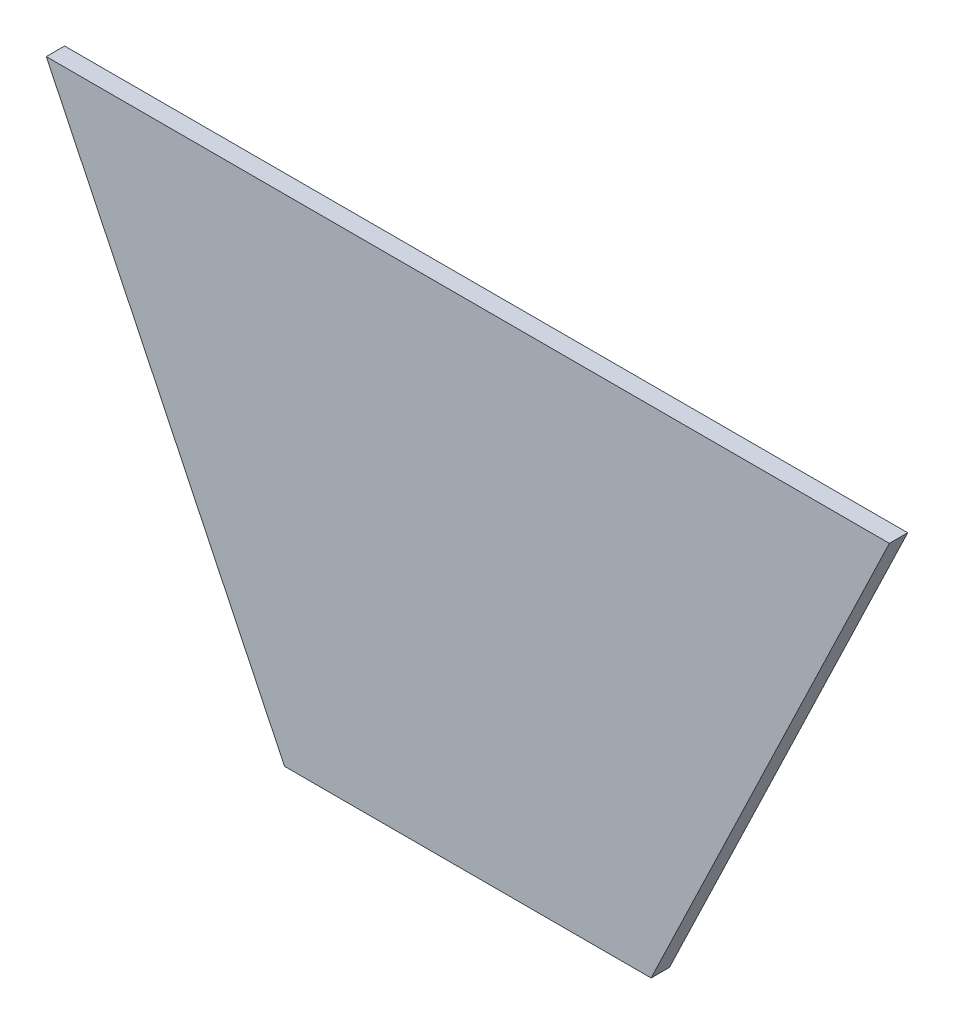
ISO-10303-21;
HEADER;
FILE_DESCRIPTION(('STEP AP214'),'2;1');
FILE_NAME('part.step','',(''),(''),'','','');
FILE_SCHEMA(('AUTOMOTIVE_DESIGN { 1 0 10303 214 1 1 1 1 }'));
ENDSEC;
DATA;
#1=APPLICATION_CONTEXT('core data for automotive mechanical design processes');
#2=APPLICATION_PROTOCOL_DEFINITION('international standard','automotive_design',2000,#1);
#3=PRODUCT_CONTEXT('',#1,'mechanical');
#4=PRODUCT('Part','Part','',(#3));
#5=PRODUCT_RELATED_PRODUCT_CATEGORY('part','',(#4));
#6=PRODUCT_DEFINITION_FORMATION('','',#4);
#7=PRODUCT_DEFINITION_CONTEXT('part definition',#1,'design');
#8=PRODUCT_DEFINITION('design','',#6,#7);
#9=PRODUCT_DEFINITION_SHAPE('','',#8);
#10=(LENGTH_UNIT() NAMED_UNIT(*) SI_UNIT(.MILLI.,.METRE.));
#11=(NAMED_UNIT(*) PLANE_ANGLE_UNIT() SI_UNIT($,.RADIAN.));
#12=(NAMED_UNIT(*) SI_UNIT($,.STERADIAN.) SOLID_ANGLE_UNIT());
#13=UNCERTAINTY_MEASURE_WITH_UNIT(LENGTH_MEASURE(1.E-05),#10,'distance_accuracy_value','');
#14=(GEOMETRIC_REPRESENTATION_CONTEXT(3) GLOBAL_UNCERTAINTY_ASSIGNED_CONTEXT((#13)) GLOBAL_UNIT_ASSIGNED_CONTEXT((#10,
#11,#12)) REPRESENTATION_CONTEXT('',''));
#15=CARTESIAN_POINT('',(0.,0.,0.));
#16=DIRECTION('',(0.,0.,1.));
#17=DIRECTION('',(1.,0.,0.));
#18=AXIS2_PLACEMENT_3D('',#15,#16,#17);
#19=CARTESIAN_POINT('',(-230.,270.370116691916,10.));
#20=DIRECTION('',(0.901233722306385,0.433333333333333,0.));
#21=DIRECTION('',(-0.433333333333333,0.901233722306385,0.));
#22=AXIS2_PLACEMENT_3D('',#19,#20,#21);
#23=PLANE('',#22);
#24=DIRECTION('',(0.433333333333333,-0.901233722306385,0.));
#25=VECTOR('',#24,1.);
#26=CARTESIAN_POINT('',(-230.,270.370116691916,0.));
#27=LINE('',#26,#25);
#28=CARTESIAN_POINT('',(-230.,270.370116691916,0.));
#29=VERTEX_POINT('',#28);
#30=CARTESIAN_POINT('',(-100.,0.,0.));
#31=VERTEX_POINT('',#30);
#32=EDGE_CURVE('E100',#29,#31,#27,.T.);
#33=ORIENTED_EDGE('',*,*,#32,.T.);
#34=DIRECTION('',(0.,0.,-1.));
#35=VECTOR('',#34,1.);
#36=CARTESIAN_POINT('',(-100.,0.,10.));
#37=LINE('',#36,#35);
#38=CARTESIAN_POINT('',(-100.,0.,10.));
#39=VERTEX_POINT('',#38);
#40=EDGE_CURVE('E11',#39,#31,#37,.T.);
#41=ORIENTED_EDGE('',*,*,#40,.F.);
#42=DIRECTION('',(0.433333333333333,-0.901233722306385,0.));
#43=VECTOR('',#42,1.);
#44=CARTESIAN_POINT('',(-230.,270.370116691916,10.));
#45=LINE('',#44,#43);
#46=CARTESIAN_POINT('',(-230.,270.370116691916,10.));
#47=VERTEX_POINT('',#46);
#48=EDGE_CURVE('E88',#47,#39,#45,.T.);
#49=ORIENTED_EDGE('',*,*,#48,.F.);
#50=DIRECTION('',(0.,0.,-1.));
#51=VECTOR('',#50,1.);
#52=CARTESIAN_POINT('',(-230.,270.370116691916,10.));
#53=LINE('',#52,#51);
#54=EDGE_CURVE('E96',#47,#29,#53,.T.);
#55=ORIENTED_EDGE('',*,*,#54,.T.);
#56=EDGE_LOOP('',(#33,#41,#49,#55));
#57=FACE_BOUND('',#56,.T.);
#58=ADVANCED_FACE('F37',(#57),#23,.F.);
#59=CARTESIAN_POINT('',(-100.,0.,10.));
#60=DIRECTION('',(0.,1.,0.));
#61=DIRECTION('',(0.,0.,1.));
#62=AXIS2_PLACEMENT_3D('',#59,#60,#61);
#63=PLANE('',#62);
#64=DIRECTION('',(1.,0.,0.));
#65=VECTOR('',#64,1.);
#66=CARTESIAN_POINT('',(-100.,0.,0.));
#67=LINE('',#66,#65);
#68=CARTESIAN_POINT('',(100.,0.,0.));
#69=VERTEX_POINT('',#68);
#70=EDGE_CURVE('E92',#31,#69,#67,.T.);
#71=ORIENTED_EDGE('',*,*,#70,.T.);
#72=DIRECTION('',(0.,0.,-1.));
#73=VECTOR('',#72,1.);
#74=CARTESIAN_POINT('',(100.,0.,10.));
#75=LINE('',#74,#73);
#76=CARTESIAN_POINT('',(100.,0.,10.));
#77=VERTEX_POINT('',#76);
#78=EDGE_CURVE('E45',#77,#69,#75,.T.);
#79=ORIENTED_EDGE('',*,*,#78,.F.);
#80=DIRECTION('',(1.,0.,0.));
#81=VECTOR('',#80,1.);
#82=CARTESIAN_POINT('',(-100.,0.,10.));
#83=LINE('',#82,#81);
#84=EDGE_CURVE('E83',#39,#77,#83,.T.);
#85=ORIENTED_EDGE('',*,*,#84,.F.);
#86=ORIENTED_EDGE('',*,*,#40,.T.);
#87=EDGE_LOOP('',(#71,#79,#85,#86));
#88=FACE_BOUND('',#87,.T.);
#89=ADVANCED_FACE('F91',(#88),#63,.F.);
#90=CARTESIAN_POINT('',(100.,0.,10.));
#91=DIRECTION('',(-0.901233722306385,0.433333333333333,0.));
#92=DIRECTION('',(-0.433333333333333,-0.901233722306385,0.));
#93=AXIS2_PLACEMENT_3D('',#90,#91,#92);
#94=PLANE('',#93);
#95=DIRECTION('',(0.433333333333333,0.901233722306385,0.));
#96=VECTOR('',#95,1.);
#97=CARTESIAN_POINT('',(100.,0.,0.));
#98=LINE('',#97,#96);
#99=CARTESIAN_POINT('',(230.,270.370116691915,0.));
#100=VERTEX_POINT('',#99);
#101=EDGE_CURVE('E70',#69,#100,#98,.T.);
#102=ORIENTED_EDGE('',*,*,#101,.T.);
#103=DIRECTION('',(0.,0.,-1.));
#104=VECTOR('',#103,1.);
#105=CARTESIAN_POINT('',(230.,270.370116691915,10.));
#106=LINE('',#105,#104);
#107=CARTESIAN_POINT('',(230.,270.370116691915,10.));
#108=VERTEX_POINT('',#107);
#109=EDGE_CURVE('E93',#108,#100,#106,.T.);
#110=ORIENTED_EDGE('',*,*,#109,.F.);
#111=DIRECTION('',(0.433333333333333,0.901233722306385,0.));
#112=VECTOR('',#111,1.);
#113=CARTESIAN_POINT('',(100.,0.,10.));
#114=LINE('',#113,#112);
#115=EDGE_CURVE('E86',#77,#108,#114,.T.);
#116=ORIENTED_EDGE('',*,*,#115,.F.);
#117=ORIENTED_EDGE('',*,*,#78,.T.);
#118=EDGE_LOOP('',(#102,#110,#116,#117));
#119=FACE_BOUND('',#118,.T.);
#120=ADVANCED_FACE('F94',(#119),#94,.F.);
#121=CARTESIAN_POINT('',(230.,270.370116691915,10.));
#122=DIRECTION('',(0.,-1.,0.));
#123=DIRECTION('',(1.,0.,0.));
#124=AXIS2_PLACEMENT_3D('',#121,#122,#123);
#125=PLANE('',#124);
#126=DIRECTION('',(-1.,0.,0.));
#127=VECTOR('',#126,1.);
#128=CARTESIAN_POINT('',(230.,270.370116691915,0.));
#129=LINE('',#128,#127);
#130=EDGE_CURVE('E76',#100,#29,#129,.T.);
#131=ORIENTED_EDGE('',*,*,#130,.T.);
#132=ORIENTED_EDGE('',*,*,#54,.F.);
#133=DIRECTION('',(-1.,0.,0.));
#134=VECTOR('',#133,1.);
#135=CARTESIAN_POINT('',(230.,270.370116691915,10.));
#136=LINE('',#135,#134);
#137=EDGE_CURVE('E53',#108,#47,#136,.T.);
#138=ORIENTED_EDGE('',*,*,#137,.F.);
#139=ORIENTED_EDGE('',*,*,#109,.T.);
#140=EDGE_LOOP('',(#131,#132,#138,#139));
#141=FACE_BOUND('',#140,.T.);
#142=ADVANCED_FACE('F107',(#141),#125,.F.);
#143=CARTESIAN_POINT('',(0.,0.,10.));
#144=DIRECTION('',(0.,0.,1.));
#145=DIRECTION('',(1.,0.,0.));
#146=AXIS2_PLACEMENT_3D('',#143,#144,#145);
#147=PLANE('',#146);
#148=ORIENTED_EDGE('',*,*,#48,.T.);
#149=ORIENTED_EDGE('',*,*,#84,.T.);
#150=ORIENTED_EDGE('',*,*,#115,.T.);
#151=ORIENTED_EDGE('',*,*,#137,.T.);
#152=EDGE_LOOP('',(#148,#149,#150,#151));
#153=FACE_BOUND('',#152,.T.);
#154=ADVANCED_FACE('F84',(#153),#147,.T.);
#155=CARTESIAN_POINT('',(0.,0.,0.));
#156=DIRECTION('',(0.,0.,1.));
#157=DIRECTION('',(1.,0.,0.));
#158=AXIS2_PLACEMENT_3D('',#155,#156,#157);
#159=PLANE('',#158);
#160=ORIENTED_EDGE('',*,*,#32,.F.);
#161=ORIENTED_EDGE('',*,*,#130,.F.);
#162=ORIENTED_EDGE('',*,*,#101,.F.);
#163=ORIENTED_EDGE('',*,*,#70,.F.);
#164=EDGE_LOOP('',(#160,#161,#162,#163));
#165=FACE_BOUND('',#164,.T.);
#166=ADVANCED_FACE('F110',(#165),#159,.F.);
#167=CLOSED_SHELL('',(#58,#89,#120,#142,#154,#166));
#168=MANIFOLD_SOLID_BREP('B2',#167);
#169=ADVANCED_BREP_SHAPE_REPRESENTATION('',(#18,#168),#14);
#170=SHAPE_DEFINITION_REPRESENTATION(#9,#169);
ENDSEC;
END-ISO-10303-21;
